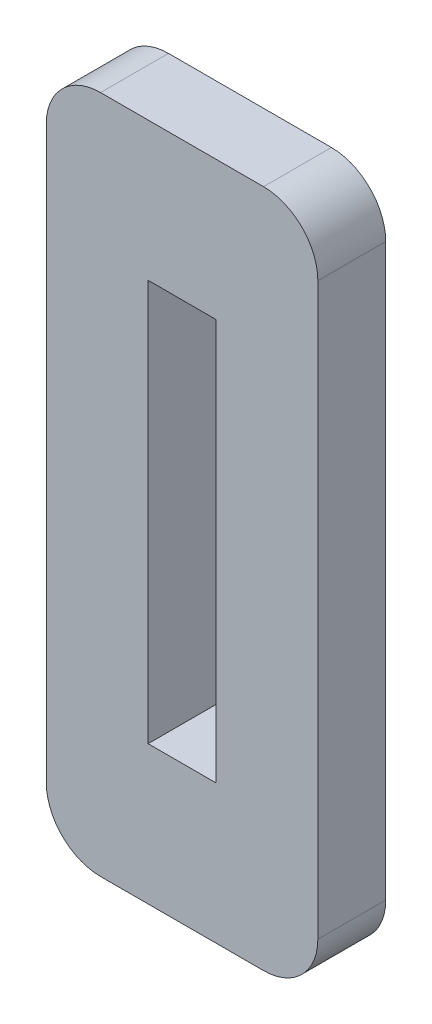
ISO-10303-21;
HEADER;
FILE_DESCRIPTION(('STEP AP214'),'2;1');
FILE_NAME('part.step','',(''),(''),'','','');
FILE_SCHEMA(('AUTOMOTIVE_DESIGN { 1 0 10303 214 1 1 1 1 }'));
ENDSEC;
DATA;
#1=APPLICATION_CONTEXT('core data for automotive mechanical design processes');
#2=APPLICATION_PROTOCOL_DEFINITION('international standard','automotive_design',2000,#1);
#3=PRODUCT_CONTEXT('',#1,'mechanical');
#4=PRODUCT('Part','Part','',(#3));
#5=PRODUCT_RELATED_PRODUCT_CATEGORY('part','',(#4));
#6=PRODUCT_DEFINITION_FORMATION('','',#4);
#7=PRODUCT_DEFINITION_CONTEXT('part definition',#1,'design');
#8=PRODUCT_DEFINITION('design','',#6,#7);
#9=PRODUCT_DEFINITION_SHAPE('','',#8);
#10=(LENGTH_UNIT() NAMED_UNIT(*) SI_UNIT(.MILLI.,.METRE.));
#11=(NAMED_UNIT(*) PLANE_ANGLE_UNIT() SI_UNIT($,.RADIAN.));
#12=(NAMED_UNIT(*) SI_UNIT($,.STERADIAN.) SOLID_ANGLE_UNIT());
#13=UNCERTAINTY_MEASURE_WITH_UNIT(LENGTH_MEASURE(1.E-05),#10,'distance_accuracy_value','');
#14=(GEOMETRIC_REPRESENTATION_CONTEXT(3) GLOBAL_UNCERTAINTY_ASSIGNED_CONTEXT((#13)) GLOBAL_UNIT_ASSIGNED_CONTEXT((#10,
#11,#12)) REPRESENTATION_CONTEXT('',''));
#15=CARTESIAN_POINT('',(0.,0.,0.));
#16=DIRECTION('',(0.,0.,1.));
#17=DIRECTION('',(1.,0.,0.));
#18=AXIS2_PLACEMENT_3D('',#15,#16,#17);
#19=CARTESIAN_POINT('',(0.,0.,2.5));
#20=DIRECTION('',(0.,0.,1.));
#21=DIRECTION('',(1.,0.,0.));
#22=AXIS2_PLACEMENT_3D('',#19,#20,#21);
#23=PLANE('',#22);
#24=DIRECTION('',(1.,0.,0.));
#25=VECTOR('',#24,1.);
#26=CARTESIAN_POINT('',(-5.,-12.5,2.5));
#27=LINE('',#26,#25);
#28=CARTESIAN_POINT('',(-3.,-12.5,2.5));
#29=VERTEX_POINT('',#28);
#30=CARTESIAN_POINT('',(3.,-12.5,2.5));
#31=VERTEX_POINT('',#30);
#32=EDGE_CURVE('E172',#29,#31,#27,.T.);
#33=ORIENTED_EDGE('',*,*,#32,.T.);
#34=CARTESIAN_POINT('',(3.,-10.5,2.5));
#35=DIRECTION('',(0.,0.,1.));
#36=DIRECTION('',(1.,0.,0.));
#37=AXIS2_PLACEMENT_3D('',#34,#35,#36);
#38=CIRCLE('',#37,2.);
#39=CARTESIAN_POINT('',(5.,-10.5,2.5));
#40=VERTEX_POINT('',#39);
#41=EDGE_CURVE('E207',#31,#40,#38,.T.);
#42=ORIENTED_EDGE('',*,*,#41,.T.);
#43=DIRECTION('',(0.,1.,0.));
#44=VECTOR('',#43,1.);
#45=CARTESIAN_POINT('',(5.,12.5,2.5));
#46=LINE('',#45,#44);
#47=CARTESIAN_POINT('',(5.,10.5,2.5));
#48=VERTEX_POINT('',#47);
#49=EDGE_CURVE('E164',#40,#48,#46,.T.);
#50=ORIENTED_EDGE('',*,*,#49,.T.);
#51=CARTESIAN_POINT('',(3.,10.5,2.5));
#52=DIRECTION('',(0.,0.,1.));
#53=DIRECTION('',(1.,0.,0.));
#54=AXIS2_PLACEMENT_3D('',#51,#52,#53);
#55=CIRCLE('',#54,2.);
#56=CARTESIAN_POINT('',(3.,12.5,2.5));
#57=VERTEX_POINT('',#56);
#58=EDGE_CURVE('E202',#48,#57,#55,.T.);
#59=ORIENTED_EDGE('',*,*,#58,.T.);
#60=DIRECTION('',(-1.,0.,0.));
#61=VECTOR('',#60,1.);
#62=CARTESIAN_POINT('',(-5.,12.5,2.5));
#63=LINE('',#62,#61);
#64=CARTESIAN_POINT('',(-3.,12.5,2.5));
#65=VERTEX_POINT('',#64);
#66=EDGE_CURVE('E167',#57,#65,#63,.T.);
#67=ORIENTED_EDGE('',*,*,#66,.T.);
#68=CARTESIAN_POINT('',(-3.,10.5,2.5));
#69=DIRECTION('',(0.,0.,1.));
#70=DIRECTION('',(1.,0.,0.));
#71=AXIS2_PLACEMENT_3D('',#68,#69,#70);
#72=CIRCLE('',#71,2.);
#73=CARTESIAN_POINT('',(-5.,10.5,2.5));
#74=VERTEX_POINT('',#73);
#75=EDGE_CURVE('E54',#65,#74,#72,.T.);
#76=ORIENTED_EDGE('',*,*,#75,.T.);
#77=DIRECTION('',(0.,-1.,0.));
#78=VECTOR('',#77,1.);
#79=CARTESIAN_POINT('',(-5.,12.5,2.5));
#80=LINE('',#79,#78);
#81=CARTESIAN_POINT('',(-5.,-10.5,2.5));
#82=VERTEX_POINT('',#81);
#83=EDGE_CURVE('E170',#74,#82,#80,.T.);
#84=ORIENTED_EDGE('',*,*,#83,.T.);
#85=CARTESIAN_POINT('',(-3.,-10.5,2.5));
#86=DIRECTION('',(0.,0.,1.));
#87=DIRECTION('',(1.,0.,0.));
#88=AXIS2_PLACEMENT_3D('',#85,#86,#87);
#89=CIRCLE('',#88,2.);
#90=EDGE_CURVE('E205',#82,#29,#89,.T.);
#91=ORIENTED_EDGE('',*,*,#90,.T.);
#92=EDGE_LOOP('',(#33,#42,#50,#59,#67,#76,#84,#91));
#93=FACE_BOUND('',#92,.T.);
#94=DIRECTION('',(-1.,0.,0.));
#95=VECTOR('',#94,1.);
#96=CARTESIAN_POINT('',(-1.25,7.38859065000001,2.5));
#97=LINE('',#96,#95);
#98=CARTESIAN_POINT('',(1.25,7.38859065000001,2.5));
#99=VERTEX_POINT('',#98);
#100=CARTESIAN_POINT('',(-1.25,7.38859065000001,2.5));
#101=VERTEX_POINT('',#100);
#102=EDGE_CURVE('E133',#99,#101,#97,.T.);
#103=ORIENTED_EDGE('',*,*,#102,.F.);
#104=DIRECTION('',(0.,1.,0.));
#105=VECTOR('',#104,1.);
#106=CARTESIAN_POINT('',(1.25,7.38859065000001,2.5));
#107=LINE('',#106,#105);
#108=CARTESIAN_POINT('',(1.25,-7.38859064999999,2.5));
#109=VERTEX_POINT('',#108);
#110=EDGE_CURVE('E123',#109,#99,#107,.T.);
#111=ORIENTED_EDGE('',*,*,#110,.F.);
#112=DIRECTION('',(1.,0.,0.));
#113=VECTOR('',#112,1.);
#114=CARTESIAN_POINT('',(-1.25,-7.38859064999999,2.5));
#115=LINE('',#114,#113);
#116=CARTESIAN_POINT('',(-1.25,-7.38859064999999,2.5));
#117=VERTEX_POINT('',#116);
#118=EDGE_CURVE('E148',#117,#109,#115,.T.);
#119=ORIENTED_EDGE('',*,*,#118,.F.);
#120=DIRECTION('',(0.,-1.,0.));
#121=VECTOR('',#120,1.);
#122=CARTESIAN_POINT('',(-1.25,7.38859065000001,2.5));
#123=LINE('',#122,#121);
#124=EDGE_CURVE('E146',#101,#117,#123,.T.);
#125=ORIENTED_EDGE('',*,*,#124,.F.);
#126=EDGE_LOOP('',(#103,#111,#119,#125));
#127=FACE_BOUND('',#126,.T.);
#128=ADVANCED_FACE('F32',(#93,#127),#23,.T.);
#129=CARTESIAN_POINT('',(0.,0.,0.));
#130=DIRECTION('',(0.,0.,1.));
#131=DIRECTION('',(1.,0.,0.));
#132=AXIS2_PLACEMENT_3D('',#129,#130,#131);
#133=PLANE('',#132);
#134=DIRECTION('',(0.,1.,0.));
#135=VECTOR('',#134,1.);
#136=CARTESIAN_POINT('',(5.,12.5,0.));
#137=LINE('',#136,#135);
#138=CARTESIAN_POINT('',(5.,-10.5,0.));
#139=VERTEX_POINT('',#138);
#140=CARTESIAN_POINT('',(5.,10.5,0.));
#141=VERTEX_POINT('',#140);
#142=EDGE_CURVE('E141',#139,#141,#137,.T.);
#143=ORIENTED_EDGE('',*,*,#142,.F.);
#144=CARTESIAN_POINT('',(3.,-10.5,0.));
#145=DIRECTION('',(0.,0.,1.));
#146=DIRECTION('',(1.,0.,0.));
#147=AXIS2_PLACEMENT_3D('',#144,#145,#146);
#148=CIRCLE('',#147,2.);
#149=CARTESIAN_POINT('',(3.,-12.5,0.));
#150=VERTEX_POINT('',#149);
#151=EDGE_CURVE('E195',#139,#150,#148,.F.);
#152=ORIENTED_EDGE('',*,*,#151,.T.);
#153=DIRECTION('',(1.,0.,0.));
#154=VECTOR('',#153,1.);
#155=CARTESIAN_POINT('',(-5.,-12.5,0.));
#156=LINE('',#155,#154);
#157=CARTESIAN_POINT('',(-3.,-12.5,0.));
#158=VERTEX_POINT('',#157);
#159=EDGE_CURVE('E168',#158,#150,#156,.T.);
#160=ORIENTED_EDGE('',*,*,#159,.F.);
#161=CARTESIAN_POINT('',(-3.,-10.5,0.));
#162=DIRECTION('',(0.,0.,1.));
#163=DIRECTION('',(1.,0.,0.));
#164=AXIS2_PLACEMENT_3D('',#161,#162,#163);
#165=CIRCLE('',#164,2.);
#166=CARTESIAN_POINT('',(-5.,-10.5,0.));
#167=VERTEX_POINT('',#166);
#168=EDGE_CURVE('E193',#158,#167,#165,.F.);
#169=ORIENTED_EDGE('',*,*,#168,.T.);
#170=DIRECTION('',(0.,-1.,0.));
#171=VECTOR('',#170,1.);
#172=CARTESIAN_POINT('',(-5.,12.5,0.));
#173=LINE('',#172,#171);
#174=CARTESIAN_POINT('',(-5.,10.5,0.));
#175=VERTEX_POINT('',#174);
#176=EDGE_CURVE('E181',#175,#167,#173,.T.);
#177=ORIENTED_EDGE('',*,*,#176,.F.);
#178=CARTESIAN_POINT('',(-3.,10.5,0.));
#179=DIRECTION('',(0.,0.,1.));
#180=DIRECTION('',(1.,0.,0.));
#181=AXIS2_PLACEMENT_3D('',#178,#179,#180);
#182=CIRCLE('',#181,2.);
#183=CARTESIAN_POINT('',(-3.,12.5,0.));
#184=VERTEX_POINT('',#183);
#185=EDGE_CURVE('E191',#175,#184,#182,.F.);
#186=ORIENTED_EDGE('',*,*,#185,.T.);
#187=DIRECTION('',(-1.,0.,0.));
#188=VECTOR('',#187,1.);
#189=CARTESIAN_POINT('',(-5.,12.5,0.));
#190=LINE('',#189,#188);
#191=CARTESIAN_POINT('',(3.,12.5,0.));
#192=VERTEX_POINT('',#191);
#193=EDGE_CURVE('E178',#192,#184,#190,.T.);
#194=ORIENTED_EDGE('',*,*,#193,.F.);
#195=CARTESIAN_POINT('',(3.,10.5,0.));
#196=DIRECTION('',(0.,0.,1.));
#197=DIRECTION('',(1.,0.,0.));
#198=AXIS2_PLACEMENT_3D('',#195,#196,#197);
#199=CIRCLE('',#198,2.);
#200=EDGE_CURVE('E189',#192,#141,#199,.F.);
#201=ORIENTED_EDGE('',*,*,#200,.T.);
#202=EDGE_LOOP('',(#143,#152,#160,#169,#177,#186,#194,#201));
#203=FACE_BOUND('',#202,.T.);
#204=DIRECTION('',(0.,1.,0.));
#205=VECTOR('',#204,1.);
#206=CARTESIAN_POINT('',(1.25,7.38859065000001,0.));
#207=LINE('',#206,#205);
#208=CARTESIAN_POINT('',(1.25,-7.38859064999999,0.));
#209=VERTEX_POINT('',#208);
#210=CARTESIAN_POINT('',(1.25,7.38859065000001,0.));
#211=VERTEX_POINT('',#210);
#212=EDGE_CURVE('E152',#209,#211,#207,.T.);
#213=ORIENTED_EDGE('',*,*,#212,.T.);
#214=DIRECTION('',(-1.,0.,0.));
#215=VECTOR('',#214,1.);
#216=CARTESIAN_POINT('',(-1.25,7.38859065000001,0.));
#217=LINE('',#216,#215);
#218=CARTESIAN_POINT('',(-1.25,7.38859065000001,0.));
#219=VERTEX_POINT('',#218);
#220=EDGE_CURVE('E140',#211,#219,#217,.T.);
#221=ORIENTED_EDGE('',*,*,#220,.T.);
#222=DIRECTION('',(0.,-1.,0.));
#223=VECTOR('',#222,1.);
#224=CARTESIAN_POINT('',(-1.25,7.38859065000001,0.));
#225=LINE('',#224,#223);
#226=CARTESIAN_POINT('',(-1.25,-7.38859064999999,0.));
#227=VERTEX_POINT('',#226);
#228=EDGE_CURVE('E155',#219,#227,#225,.T.);
#229=ORIENTED_EDGE('',*,*,#228,.T.);
#230=DIRECTION('',(1.,0.,0.));
#231=VECTOR('',#230,1.);
#232=CARTESIAN_POINT('',(-1.25,-7.38859064999999,0.));
#233=LINE('',#232,#231);
#234=EDGE_CURVE('E134',#227,#209,#233,.T.);
#235=ORIENTED_EDGE('',*,*,#234,.T.);
#236=EDGE_LOOP('',(#213,#221,#229,#235));
#237=FACE_BOUND('',#236,.T.);
#238=ADVANCED_FACE('F223',(#203,#237),#133,.F.);
#239=CARTESIAN_POINT('',(5.,12.5,2.5));
#240=DIRECTION('',(-1.,0.,0.));
#241=DIRECTION('',(0.,-1.,0.));
#242=AXIS2_PLACEMENT_3D('',#239,#240,#241);
#243=PLANE('',#242);
#244=ORIENTED_EDGE('',*,*,#49,.F.);
#245=DIRECTION('',(0.,0.,-1.));
#246=VECTOR('',#245,1.);
#247=CARTESIAN_POINT('',(5.,-10.5,2.5));
#248=LINE('',#247,#246);
#249=EDGE_CURVE('E186',#40,#139,#248,.T.);
#250=ORIENTED_EDGE('',*,*,#249,.T.);
#251=ORIENTED_EDGE('',*,*,#142,.T.);
#252=DIRECTION('',(0.,0.,-1.));
#253=VECTOR('',#252,1.);
#254=CARTESIAN_POINT('',(5.,10.5,2.5));
#255=LINE('',#254,#253);
#256=EDGE_CURVE('E175',#141,#48,#255,.F.);
#257=ORIENTED_EDGE('',*,*,#256,.T.);
#258=EDGE_LOOP('',(#244,#250,#251,#257));
#259=FACE_BOUND('',#258,.T.);
#260=ADVANCED_FACE('F245',(#259),#243,.F.);
#261=CARTESIAN_POINT('',(-5.,12.5,2.5));
#262=DIRECTION('',(0.,-1.,0.));
#263=DIRECTION('',(0.,0.,-1.));
#264=AXIS2_PLACEMENT_3D('',#261,#262,#263);
#265=PLANE('',#264);
#266=ORIENTED_EDGE('',*,*,#193,.T.);
#267=DIRECTION('',(0.,0.,-1.));
#268=VECTOR('',#267,1.);
#269=CARTESIAN_POINT('',(-3.,12.5,2.5));
#270=LINE('',#269,#268);
#271=EDGE_CURVE('E11',#184,#65,#270,.F.);
#272=ORIENTED_EDGE('',*,*,#271,.T.);
#273=ORIENTED_EDGE('',*,*,#66,.F.);
#274=DIRECTION('',(0.,0.,-1.));
#275=VECTOR('',#274,1.);
#276=CARTESIAN_POINT('',(3.,12.5,2.5));
#277=LINE('',#276,#275);
#278=EDGE_CURVE('E40',#57,#192,#277,.T.);
#279=ORIENTED_EDGE('',*,*,#278,.T.);
#280=EDGE_LOOP('',(#266,#272,#273,#279));
#281=FACE_BOUND('',#280,.T.);
#282=ADVANCED_FACE('F217',(#281),#265,.F.);
#283=CARTESIAN_POINT('',(-5.,12.5,2.5));
#284=DIRECTION('',(1.,0.,0.));
#285=DIRECTION('',(0.,1.,0.));
#286=AXIS2_PLACEMENT_3D('',#283,#284,#285);
#287=PLANE('',#286);
#288=ORIENTED_EDGE('',*,*,#176,.T.);
#289=DIRECTION('',(0.,0.,-1.));
#290=VECTOR('',#289,1.);
#291=CARTESIAN_POINT('',(-5.,-10.5,2.5));
#292=LINE('',#291,#290);
#293=EDGE_CURVE('E47',#167,#82,#292,.F.);
#294=ORIENTED_EDGE('',*,*,#293,.T.);
#295=ORIENTED_EDGE('',*,*,#83,.F.);
#296=DIRECTION('',(0.,0.,-1.));
#297=VECTOR('',#296,1.);
#298=CARTESIAN_POINT('',(-5.,10.5,2.5));
#299=LINE('',#298,#297);
#300=EDGE_CURVE('E209',#74,#175,#299,.T.);
#301=ORIENTED_EDGE('',*,*,#300,.T.);
#302=EDGE_LOOP('',(#288,#294,#295,#301));
#303=FACE_BOUND('',#302,.T.);
#304=ADVANCED_FACE('F229',(#303),#287,.F.);
#305=CARTESIAN_POINT('',(-5.,-12.5,2.5));
#306=DIRECTION('',(0.,1.,0.));
#307=DIRECTION('',(0.,0.,1.));
#308=AXIS2_PLACEMENT_3D('',#305,#306,#307);
#309=PLANE('',#308);
#310=ORIENTED_EDGE('',*,*,#159,.T.);
#311=DIRECTION('',(0.,0.,-1.));
#312=VECTOR('',#311,1.);
#313=CARTESIAN_POINT('',(3.,-12.5,2.5));
#314=LINE('',#313,#312);
#315=EDGE_CURVE('E200',#150,#31,#314,.F.);
#316=ORIENTED_EDGE('',*,*,#315,.T.);
#317=ORIENTED_EDGE('',*,*,#32,.F.);
#318=DIRECTION('',(0.,0.,-1.));
#319=VECTOR('',#318,1.);
#320=CARTESIAN_POINT('',(-3.,-12.5,2.5));
#321=LINE('',#320,#319);
#322=EDGE_CURVE('E197',#29,#158,#321,.T.);
#323=ORIENTED_EDGE('',*,*,#322,.T.);
#324=EDGE_LOOP('',(#310,#316,#317,#323));
#325=FACE_BOUND('',#324,.T.);
#326=ADVANCED_FACE('F237',(#325),#309,.F.);
#327=CARTESIAN_POINT('',(1.25,7.38859065000001,2.5));
#328=DIRECTION('',(-1.,0.,0.));
#329=DIRECTION('',(0.,-1.,0.));
#330=AXIS2_PLACEMENT_3D('',#327,#328,#329);
#331=PLANE('',#330);
#332=ORIENTED_EDGE('',*,*,#212,.F.);
#333=DIRECTION('',(0.,0.,-1.));
#334=VECTOR('',#333,1.);
#335=CARTESIAN_POINT('',(1.25,-7.38859064999999,2.5));
#336=LINE('',#335,#334);
#337=EDGE_CURVE('E129',#109,#209,#336,.T.);
#338=ORIENTED_EDGE('',*,*,#337,.F.);
#339=ORIENTED_EDGE('',*,*,#110,.T.);
#340=DIRECTION('',(0.,0.,-1.));
#341=VECTOR('',#340,1.);
#342=CARTESIAN_POINT('',(1.25,7.38859065000001,2.5));
#343=LINE('',#342,#341);
#344=EDGE_CURVE('E126',#99,#211,#343,.T.);
#345=ORIENTED_EDGE('',*,*,#344,.T.);
#346=EDGE_LOOP('',(#332,#338,#339,#345));
#347=FACE_BOUND('',#346,.T.);
#348=ADVANCED_FACE('F125',(#347),#331,.T.);
#349=CARTESIAN_POINT('',(-1.25,7.38859065000001,2.5));
#350=DIRECTION('',(0.,-1.,0.));
#351=DIRECTION('',(0.,0.,-1.));
#352=AXIS2_PLACEMENT_3D('',#349,#350,#351);
#353=PLANE('',#352);
#354=ORIENTED_EDGE('',*,*,#220,.F.);
#355=ORIENTED_EDGE('',*,*,#344,.F.);
#356=ORIENTED_EDGE('',*,*,#102,.T.);
#357=DIRECTION('',(0.,0.,-1.));
#358=VECTOR('',#357,1.);
#359=CARTESIAN_POINT('',(-1.25,7.38859065000001,2.5));
#360=LINE('',#359,#358);
#361=EDGE_CURVE('E142',#101,#219,#360,.T.);
#362=ORIENTED_EDGE('',*,*,#361,.T.);
#363=EDGE_LOOP('',(#354,#355,#356,#362));
#364=FACE_BOUND('',#363,.T.);
#365=ADVANCED_FACE('F137',(#364),#353,.T.);
#366=CARTESIAN_POINT('',(-1.25,7.38859065000001,2.5));
#367=DIRECTION('',(1.,0.,0.));
#368=DIRECTION('',(0.,1.,0.));
#369=AXIS2_PLACEMENT_3D('',#366,#367,#368);
#370=PLANE('',#369);
#371=ORIENTED_EDGE('',*,*,#228,.F.);
#372=ORIENTED_EDGE('',*,*,#361,.F.);
#373=ORIENTED_EDGE('',*,*,#124,.T.);
#374=DIRECTION('',(0.,0.,-1.));
#375=VECTOR('',#374,1.);
#376=CARTESIAN_POINT('',(-1.25,-7.38859064999999,2.5));
#377=LINE('',#376,#375);
#378=EDGE_CURVE('E161',#117,#227,#377,.T.);
#379=ORIENTED_EDGE('',*,*,#378,.T.);
#380=EDGE_LOOP('',(#371,#372,#373,#379));
#381=FACE_BOUND('',#380,.T.);
#382=ADVANCED_FACE('F301',(#381),#370,.T.);
#383=CARTESIAN_POINT('',(-1.25,-7.38859064999999,2.5));
#384=DIRECTION('',(0.,1.,0.));
#385=DIRECTION('',(0.,0.,1.));
#386=AXIS2_PLACEMENT_3D('',#383,#384,#385);
#387=PLANE('',#386);
#388=ORIENTED_EDGE('',*,*,#234,.F.);
#389=ORIENTED_EDGE('',*,*,#378,.F.);
#390=ORIENTED_EDGE('',*,*,#118,.T.);
#391=ORIENTED_EDGE('',*,*,#337,.T.);
#392=EDGE_LOOP('',(#388,#389,#390,#391));
#393=FACE_BOUND('',#392,.T.);
#394=ADVANCED_FACE('F270',(#393),#387,.T.);
#395=CARTESIAN_POINT('',(3.,-10.5,2.5));
#396=DIRECTION('',(0.,0.,-1.));
#397=DIRECTION('',(-1.,0.,0.));
#398=AXIS2_PLACEMENT_3D('',#395,#396,#397);
#399=CYLINDRICAL_SURFACE('',#398,2.);
#400=ORIENTED_EDGE('',*,*,#41,.F.);
#401=ORIENTED_EDGE('',*,*,#315,.F.);
#402=ORIENTED_EDGE('',*,*,#151,.F.);
#403=ORIENTED_EDGE('',*,*,#249,.F.);
#404=EDGE_LOOP('',(#400,#401,#402,#403));
#405=FACE_BOUND('',#404,.T.);
#406=ADVANCED_FACE('F242',(#405),#399,.T.);
#407=CARTESIAN_POINT('',(-3.,-10.5,2.5));
#408=DIRECTION('',(0.,0.,-1.));
#409=DIRECTION('',(-1.,0.,0.));
#410=AXIS2_PLACEMENT_3D('',#407,#408,#409);
#411=CYLINDRICAL_SURFACE('',#410,2.);
#412=ORIENTED_EDGE('',*,*,#90,.F.);
#413=ORIENTED_EDGE('',*,*,#293,.F.);
#414=ORIENTED_EDGE('',*,*,#168,.F.);
#415=ORIENTED_EDGE('',*,*,#322,.F.);
#416=EDGE_LOOP('',(#412,#413,#414,#415));
#417=FACE_BOUND('',#416,.T.);
#418=ADVANCED_FACE('F234',(#417),#411,.T.);
#419=CARTESIAN_POINT('',(-3.,10.5,2.5));
#420=DIRECTION('',(0.,0.,-1.));
#421=DIRECTION('',(-1.,0.,0.));
#422=AXIS2_PLACEMENT_3D('',#419,#420,#421);
#423=CYLINDRICAL_SURFACE('',#422,2.);
#424=ORIENTED_EDGE('',*,*,#75,.F.);
#425=ORIENTED_EDGE('',*,*,#271,.F.);
#426=ORIENTED_EDGE('',*,*,#185,.F.);
#427=ORIENTED_EDGE('',*,*,#300,.F.);
#428=EDGE_LOOP('',(#424,#425,#426,#427));
#429=FACE_BOUND('',#428,.T.);
#430=ADVANCED_FACE('F228',(#429),#423,.T.);
#431=CARTESIAN_POINT('',(3.,10.5,2.5));
#432=DIRECTION('',(0.,0.,-1.));
#433=DIRECTION('',(-1.,0.,0.));
#434=AXIS2_PLACEMENT_3D('',#431,#432,#433);
#435=CYLINDRICAL_SURFACE('',#434,2.);
#436=ORIENTED_EDGE('',*,*,#58,.F.);
#437=ORIENTED_EDGE('',*,*,#256,.F.);
#438=ORIENTED_EDGE('',*,*,#200,.F.);
#439=ORIENTED_EDGE('',*,*,#278,.F.);
#440=EDGE_LOOP('',(#436,#437,#438,#439));
#441=FACE_BOUND('',#440,.T.);
#442=ADVANCED_FACE('F34',(#441),#435,.T.);
#443=CLOSED_SHELL('',(#128,#238,#260,#282,#304,#326,#348,#365,#382,#394,#406,#418,#430,#442));
#444=MANIFOLD_SOLID_BREP('B2',#443);
#445=ADVANCED_BREP_SHAPE_REPRESENTATION('',(#18,#444),#14);
#446=SHAPE_DEFINITION_REPRESENTATION(#9,#445);
ENDSEC;
END-ISO-10303-21;
